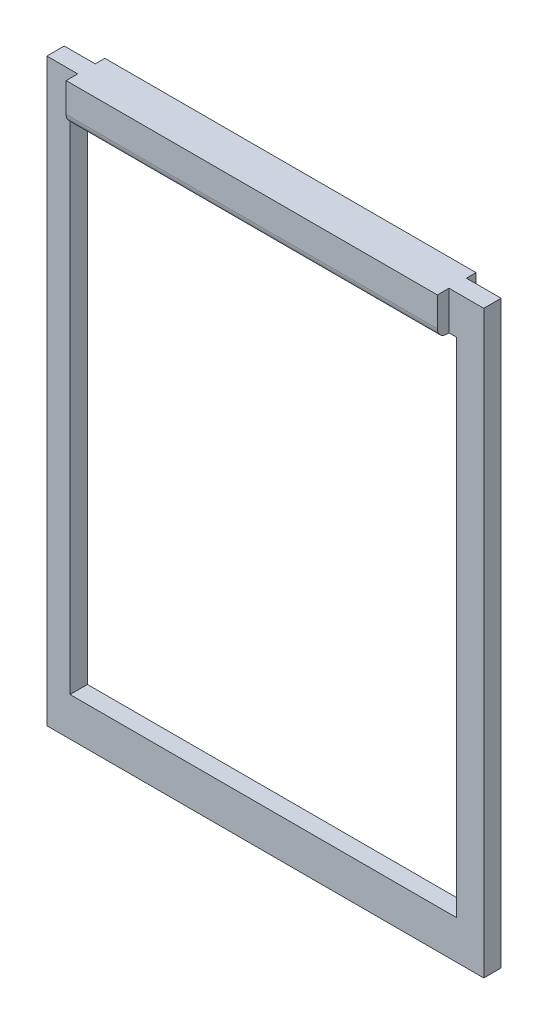
ISO-10303-21;
HEADER;
FILE_DESCRIPTION(('STEP AP214'),'2;1');
FILE_NAME('part.step','',(''),(''),'','','');
FILE_SCHEMA(('AUTOMOTIVE_DESIGN { 1 0 10303 214 1 1 1 1 }'));
ENDSEC;
DATA;
#1=APPLICATION_CONTEXT('core data for automotive mechanical design processes');
#2=APPLICATION_PROTOCOL_DEFINITION('international standard','automotive_design',2000,#1);
#3=PRODUCT_CONTEXT('',#1,'mechanical');
#4=PRODUCT('Part','Part','',(#3));
#5=PRODUCT_RELATED_PRODUCT_CATEGORY('part','',(#4));
#6=PRODUCT_DEFINITION_FORMATION('','',#4);
#7=PRODUCT_DEFINITION_CONTEXT('part definition',#1,'design');
#8=PRODUCT_DEFINITION('design','',#6,#7);
#9=PRODUCT_DEFINITION_SHAPE('','',#8);
#10=(LENGTH_UNIT() NAMED_UNIT(*) SI_UNIT(.MILLI.,.METRE.));
#11=(NAMED_UNIT(*) PLANE_ANGLE_UNIT() SI_UNIT($,.RADIAN.));
#12=(NAMED_UNIT(*) SI_UNIT($,.STERADIAN.) SOLID_ANGLE_UNIT());
#13=UNCERTAINTY_MEASURE_WITH_UNIT(LENGTH_MEASURE(1.E-05),#10,'distance_accuracy_value','');
#14=(GEOMETRIC_REPRESENTATION_CONTEXT(3) GLOBAL_UNCERTAINTY_ASSIGNED_CONTEXT((#13)) GLOBAL_UNIT_ASSIGNED_CONTEXT((#10,
#11,#12)) REPRESENTATION_CONTEXT('',''));
#15=CARTESIAN_POINT('',(0.,0.,0.));
#16=DIRECTION('',(0.,0.,1.));
#17=DIRECTION('',(1.,0.,0.));
#18=AXIS2_PLACEMENT_3D('',#15,#16,#17);
#19=CARTESIAN_POINT('',(0.,0.,2.25));
#20=DIRECTION('',(0.,0.,1.));
#21=DIRECTION('',(1.,0.,0.));
#22=AXIS2_PLACEMENT_3D('',#19,#20,#21);
#23=PLANE('',#22);
#24=DIRECTION('',(-1.,0.,0.));
#25=VECTOR('',#24,1.);
#26=CARTESIAN_POINT('',(56.5,75.,2.25));
#27=LINE('',#26,#25);
#28=CARTESIAN_POINT('',(56.5,75.,2.25));
#29=VERTEX_POINT('',#28);
#30=CARTESIAN_POINT('',(52.,75.,2.25));
#31=VERTEX_POINT('',#30);
#32=EDGE_CURVE('E302',#29,#31,#27,.T.);
#33=ORIENTED_EDGE('',*,*,#32,.T.);
#34=DIRECTION('',(0.,-1.,0.));
#35=VECTOR('',#34,1.);
#36=CARTESIAN_POINT('',(52.,75.,2.25));
#37=LINE('',#36,#35);
#38=CARTESIAN_POINT('',(52.,70.,2.25));
#39=VERTEX_POINT('',#38);
#40=EDGE_CURVE('E218',#31,#39,#37,.T.);
#41=ORIENTED_EDGE('',*,*,#40,.T.);
#42=DIRECTION('',(-1.,0.,0.));
#43=VECTOR('',#42,1.);
#44=CARTESIAN_POINT('',(53.,70.,2.25));
#45=LINE('',#44,#43);
#46=CARTESIAN_POINT('',(53.,70.,2.25));
#47=VERTEX_POINT('',#46);
#48=EDGE_CURVE('E245',#47,#39,#45,.T.);
#49=ORIENTED_EDGE('',*,*,#48,.F.);
#50=DIRECTION('',(0.,1.,0.));
#51=VECTOR('',#50,1.);
#52=CARTESIAN_POINT('',(53.,4.99999999999998,2.25));
#53=LINE('',#52,#51);
#54=CARTESIAN_POINT('',(53.,4.99999999999998,2.25));
#55=VERTEX_POINT('',#54);
#56=EDGE_CURVE('E257',#55,#47,#53,.T.);
#57=ORIENTED_EDGE('',*,*,#56,.F.);
#58=DIRECTION('',(1.,0.,0.));
#59=VECTOR('',#58,1.);
#60=CARTESIAN_POINT('',(3.00000000000001,4.99999999999998,2.25));
#61=LINE('',#60,#59);
#62=CARTESIAN_POINT('',(3.00000000000001,4.99999999999998,2.25));
#63=VERTEX_POINT('',#62);
#64=EDGE_CURVE('E253',#63,#55,#61,.T.);
#65=ORIENTED_EDGE('',*,*,#64,.F.);
#66=DIRECTION('',(0.,-1.,0.));
#67=VECTOR('',#66,1.);
#68=CARTESIAN_POINT('',(3.,70.,2.25));
#69=LINE('',#68,#67);
#70=CARTESIAN_POINT('',(3.,70.,2.25));
#71=VERTEX_POINT('',#70);
#72=EDGE_CURVE('E249',#71,#63,#69,.T.);
#73=ORIENTED_EDGE('',*,*,#72,.F.);
#74=CARTESIAN_POINT('',(4.,70.,2.25));
#75=VERTEX_POINT('',#74);
#76=EDGE_CURVE('E250',#75,#71,#45,.T.);
#77=ORIENTED_EDGE('',*,*,#76,.F.);
#78=DIRECTION('',(0.,-1.,0.));
#79=VECTOR('',#78,1.);
#80=CARTESIAN_POINT('',(4.,75.,2.25));
#81=LINE('',#80,#79);
#82=CARTESIAN_POINT('',(4.,75.,2.25));
#83=VERTEX_POINT('',#82);
#84=EDGE_CURVE('E212',#83,#75,#81,.T.);
#85=ORIENTED_EDGE('',*,*,#84,.F.);
#86=CARTESIAN_POINT('',(0.,75.,2.25));
#87=VERTEX_POINT('',#86);
#88=EDGE_CURVE('E301',#83,#87,#27,.T.);
#89=ORIENTED_EDGE('',*,*,#88,.T.);
#90=DIRECTION('',(0.,-1.,0.));
#91=VECTOR('',#90,1.);
#92=CARTESIAN_POINT('',(0.,75.,2.25));
#93=LINE('',#92,#91);
#94=CARTESIAN_POINT('',(0.,0.,2.25));
#95=VERTEX_POINT('',#94);
#96=EDGE_CURVE('E291',#87,#95,#93,.T.);
#97=ORIENTED_EDGE('',*,*,#96,.T.);
#98=DIRECTION('',(1.,0.,0.));
#99=VECTOR('',#98,1.);
#100=CARTESIAN_POINT('',(0.,0.,2.25));
#101=LINE('',#100,#99);
#102=CARTESIAN_POINT('',(56.5,0.,2.25));
#103=VERTEX_POINT('',#102);
#104=EDGE_CURVE('E295',#95,#103,#101,.T.);
#105=ORIENTED_EDGE('',*,*,#104,.T.);
#106=DIRECTION('',(0.,1.,0.));
#107=VECTOR('',#106,1.);
#108=CARTESIAN_POINT('',(56.5,0.,2.25));
#109=LINE('',#108,#107);
#110=EDGE_CURVE('E298',#103,#29,#109,.T.);
#111=ORIENTED_EDGE('',*,*,#110,.T.);
#112=EDGE_LOOP('',(#33,#41,#49,#57,#65,#73,#77,#85,#89,#97,#105,#111));
#113=FACE_BOUND('',#112,.T.);
#114=ADVANCED_FACE('F39',(#113),#23,.T.);
#115=CARTESIAN_POINT('',(0.,0.,0.));
#116=DIRECTION('',(0.,0.,1.));
#117=DIRECTION('',(1.,0.,0.));
#118=AXIS2_PLACEMENT_3D('',#115,#116,#117);
#119=PLANE('',#118);
#120=DIRECTION('',(-1.,0.,0.));
#121=VECTOR('',#120,1.);
#122=CARTESIAN_POINT('',(53.,70.,0.));
#123=LINE('',#122,#121);
#124=CARTESIAN_POINT('',(53.,70.,0.));
#125=VERTEX_POINT('',#124);
#126=CARTESIAN_POINT('',(52.,70.,0.));
#127=VERTEX_POINT('',#126);
#128=EDGE_CURVE('E261',#125,#127,#123,.T.);
#129=ORIENTED_EDGE('',*,*,#128,.T.);
#130=DIRECTION('',(0.,1.,0.));
#131=VECTOR('',#130,1.);
#132=CARTESIAN_POINT('',(52.,0.,0.));
#133=LINE('',#132,#131);
#134=CARTESIAN_POINT('',(52.,75.,0.));
#135=VERTEX_POINT('',#134);
#136=EDGE_CURVE('E209',#127,#135,#133,.T.);
#137=ORIENTED_EDGE('',*,*,#136,.T.);
#138=DIRECTION('',(-1.,0.,0.));
#139=VECTOR('',#138,1.);
#140=CARTESIAN_POINT('',(56.5,75.,0.));
#141=LINE('',#140,#139);
#142=CARTESIAN_POINT('',(56.5,75.,0.));
#143=VERTEX_POINT('',#142);
#144=EDGE_CURVE('E184',#143,#135,#141,.T.);
#145=ORIENTED_EDGE('',*,*,#144,.F.);
#146=DIRECTION('',(0.,1.,0.));
#147=VECTOR('',#146,1.);
#148=CARTESIAN_POINT('',(56.5,0.,0.));
#149=LINE('',#148,#147);
#150=CARTESIAN_POINT('',(56.5,0.,0.));
#151=VERTEX_POINT('',#150);
#152=EDGE_CURVE('E312',#151,#143,#149,.T.);
#153=ORIENTED_EDGE('',*,*,#152,.F.);
#154=DIRECTION('',(1.,0.,0.));
#155=VECTOR('',#154,1.);
#156=CARTESIAN_POINT('',(0.,0.,0.));
#157=LINE('',#156,#155);
#158=CARTESIAN_POINT('',(0.,0.,0.));
#159=VERTEX_POINT('',#158);
#160=EDGE_CURVE('E309',#159,#151,#157,.T.);
#161=ORIENTED_EDGE('',*,*,#160,.F.);
#162=DIRECTION('',(0.,-1.,0.));
#163=VECTOR('',#162,1.);
#164=CARTESIAN_POINT('',(0.,75.,0.));
#165=LINE('',#164,#163);
#166=CARTESIAN_POINT('',(0.,75.,0.));
#167=VERTEX_POINT('',#166);
#168=EDGE_CURVE('E290',#167,#159,#165,.T.);
#169=ORIENTED_EDGE('',*,*,#168,.F.);
#170=CARTESIAN_POINT('',(4.,75.,0.));
#171=VERTEX_POINT('',#170);
#172=EDGE_CURVE('E315',#171,#167,#141,.T.);
#173=ORIENTED_EDGE('',*,*,#172,.F.);
#174=DIRECTION('',(0.,-1.,0.));
#175=VECTOR('',#174,1.);
#176=CARTESIAN_POINT('',(3.99999999999998,0.,0.));
#177=LINE('',#176,#175);
#178=CARTESIAN_POINT('',(4.,70.,0.));
#179=VERTEX_POINT('',#178);
#180=EDGE_CURVE('E200',#171,#179,#177,.T.);
#181=ORIENTED_EDGE('',*,*,#180,.T.);
#182=CARTESIAN_POINT('',(3.,70.,0.));
#183=VERTEX_POINT('',#182);
#184=EDGE_CURVE('E244',#179,#183,#123,.T.);
#185=ORIENTED_EDGE('',*,*,#184,.T.);
#186=DIRECTION('',(0.,-1.,0.));
#187=VECTOR('',#186,1.);
#188=CARTESIAN_POINT('',(3.,70.,0.));
#189=LINE('',#188,#187);
#190=CARTESIAN_POINT('',(3.00000000000001,4.99999999999998,0.));
#191=VERTEX_POINT('',#190);
#192=EDGE_CURVE('E265',#183,#191,#189,.T.);
#193=ORIENTED_EDGE('',*,*,#192,.T.);
#194=DIRECTION('',(1.,0.,0.));
#195=VECTOR('',#194,1.);
#196=CARTESIAN_POINT('',(3.00000000000001,4.99999999999998,0.));
#197=LINE('',#196,#195);
#198=CARTESIAN_POINT('',(53.,4.99999999999998,0.));
#199=VERTEX_POINT('',#198);
#200=EDGE_CURVE('E269',#191,#199,#197,.T.);
#201=ORIENTED_EDGE('',*,*,#200,.T.);
#202=DIRECTION('',(0.,1.,0.));
#203=VECTOR('',#202,1.);
#204=CARTESIAN_POINT('',(53.,4.99999999999998,0.));
#205=LINE('',#204,#203);
#206=EDGE_CURVE('E273',#199,#125,#205,.T.);
#207=ORIENTED_EDGE('',*,*,#206,.T.);
#208=EDGE_LOOP('',(#129,#137,#145,#153,#161,#169,#173,#181,#185,#193,#201,#207));
#209=FACE_BOUND('',#208,.T.);
#210=ADVANCED_FACE('F357',(#209),#119,.F.);
#211=CARTESIAN_POINT('',(0.,75.,2.25));
#212=DIRECTION('',(1.,0.,0.));
#213=DIRECTION('',(0.,1.,0.));
#214=AXIS2_PLACEMENT_3D('',#211,#212,#213);
#215=PLANE('',#214);
#216=ORIENTED_EDGE('',*,*,#168,.T.);
#217=DIRECTION('',(0.,0.,-1.));
#218=VECTOR('',#217,1.);
#219=CARTESIAN_POINT('',(0.,0.,2.25));
#220=LINE('',#219,#218);
#221=EDGE_CURVE('E328',#95,#159,#220,.T.);
#222=ORIENTED_EDGE('',*,*,#221,.F.);
#223=ORIENTED_EDGE('',*,*,#96,.F.);
#224=DIRECTION('',(0.,0.,-1.));
#225=VECTOR('',#224,1.);
#226=CARTESIAN_POINT('',(0.,75.,2.25));
#227=LINE('',#226,#225);
#228=EDGE_CURVE('E305',#87,#167,#227,.T.);
#229=ORIENTED_EDGE('',*,*,#228,.T.);
#230=EDGE_LOOP('',(#216,#222,#223,#229));
#231=FACE_BOUND('',#230,.T.);
#232=ADVANCED_FACE('F380',(#231),#215,.F.);
#233=CARTESIAN_POINT('',(0.,0.,2.25));
#234=DIRECTION('',(0.,1.,0.));
#235=DIRECTION('',(0.,0.,1.));
#236=AXIS2_PLACEMENT_3D('',#233,#234,#235);
#237=PLANE('',#236);
#238=ORIENTED_EDGE('',*,*,#160,.T.);
#239=DIRECTION('',(0.,0.,-1.));
#240=VECTOR('',#239,1.);
#241=CARTESIAN_POINT('',(56.5,0.,2.25));
#242=LINE('',#241,#240);
#243=EDGE_CURVE('E324',#103,#151,#242,.T.);
#244=ORIENTED_EDGE('',*,*,#243,.F.);
#245=ORIENTED_EDGE('',*,*,#104,.F.);
#246=ORIENTED_EDGE('',*,*,#221,.T.);
#247=EDGE_LOOP('',(#238,#244,#245,#246));
#248=FACE_BOUND('',#247,.T.);
#249=ADVANCED_FACE('F383',(#248),#237,.F.);
#250=CARTESIAN_POINT('',(56.5,0.,2.25));
#251=DIRECTION('',(-1.,0.,0.));
#252=DIRECTION('',(0.,0.,1.));
#253=AXIS2_PLACEMENT_3D('',#250,#251,#252);
#254=PLANE('',#253);
#255=ORIENTED_EDGE('',*,*,#152,.T.);
#256=DIRECTION('',(0.,0.,-1.));
#257=VECTOR('',#256,1.);
#258=CARTESIAN_POINT('',(56.5,75.,2.25));
#259=LINE('',#258,#257);
#260=EDGE_CURVE('E321',#29,#143,#259,.T.);
#261=ORIENTED_EDGE('',*,*,#260,.F.);
#262=ORIENTED_EDGE('',*,*,#110,.F.);
#263=ORIENTED_EDGE('',*,*,#243,.T.);
#264=EDGE_LOOP('',(#255,#261,#262,#263));
#265=FACE_BOUND('',#264,.T.);
#266=ADVANCED_FACE('F388',(#265),#254,.F.);
#267=CARTESIAN_POINT('',(56.5,75.,2.25));
#268=DIRECTION('',(0.,-1.,0.));
#269=DIRECTION('',(1.,0.,0.));
#270=AXIS2_PLACEMENT_3D('',#267,#268,#269);
#271=PLANE('',#270);
#272=ORIENTED_EDGE('',*,*,#88,.F.);
#273=DIRECTION('',(0.,0.,-1.));
#274=VECTOR('',#273,1.);
#275=CARTESIAN_POINT('',(4.,75.,3.75));
#276=LINE('',#275,#274);
#277=CARTESIAN_POINT('',(4.,75.,3.75));
#278=VERTEX_POINT('',#277);
#279=EDGE_CURVE('E240',#278,#83,#276,.T.);
#280=ORIENTED_EDGE('',*,*,#279,.F.);
#281=DIRECTION('',(-1.,0.,0.));
#282=VECTOR('',#281,1.);
#283=CARTESIAN_POINT('',(52.,75.,3.75));
#284=LINE('',#283,#282);
#285=CARTESIAN_POINT('',(52.,75.,3.75));
#286=VERTEX_POINT('',#285);
#287=EDGE_CURVE('E213',#286,#278,#284,.T.);
#288=ORIENTED_EDGE('',*,*,#287,.F.);
#289=DIRECTION('',(0.,0.,-1.));
#290=VECTOR('',#289,1.);
#291=CARTESIAN_POINT('',(52.,75.,3.75));
#292=LINE('',#291,#290);
#293=EDGE_CURVE('E224',#286,#31,#292,.T.);
#294=ORIENTED_EDGE('',*,*,#293,.T.);
#295=ORIENTED_EDGE('',*,*,#32,.F.);
#296=ORIENTED_EDGE('',*,*,#260,.T.);
#297=ORIENTED_EDGE('',*,*,#144,.T.);
#298=DIRECTION('',(0.,0.,1.));
#299=VECTOR('',#298,1.);
#300=CARTESIAN_POINT('',(52.,75.,-1.25));
#301=LINE('',#300,#299);
#302=CARTESIAN_POINT('',(52.,75.,-1.25));
#303=VERTEX_POINT('',#302);
#304=EDGE_CURVE('E168',#303,#135,#301,.T.);
#305=ORIENTED_EDGE('',*,*,#304,.F.);
#306=DIRECTION('',(-1.,0.,0.));
#307=VECTOR('',#306,1.);
#308=CARTESIAN_POINT('',(52.,75.,-1.25));
#309=LINE('',#308,#307);
#310=CARTESIAN_POINT('',(4.,75.,-1.25));
#311=VERTEX_POINT('',#310);
#312=EDGE_CURVE('E175',#303,#311,#309,.T.);
#313=ORIENTED_EDGE('',*,*,#312,.T.);
#314=DIRECTION('',(0.,0.,1.));
#315=VECTOR('',#314,1.);
#316=CARTESIAN_POINT('',(4.,75.,-1.25));
#317=LINE('',#316,#315);
#318=EDGE_CURVE('E186',#311,#171,#317,.T.);
#319=ORIENTED_EDGE('',*,*,#318,.T.);
#320=ORIENTED_EDGE('',*,*,#172,.T.);
#321=ORIENTED_EDGE('',*,*,#228,.F.);
#322=EDGE_LOOP('',(#272,#280,#288,#294,#295,#296,#297,#305,#313,#319,#320,#321));
#323=FACE_BOUND('',#322,.T.);
#324=ADVANCED_FACE('F181',(#323),#271,.F.);
#325=CARTESIAN_POINT('',(53.,70.,2.25));
#326=DIRECTION('',(0.,-1.,0.));
#327=DIRECTION('',(0.,0.,-1.));
#328=AXIS2_PLACEMENT_3D('',#325,#326,#327);
#329=PLANE('',#328);
#330=DIRECTION('',(0.,0.,1.));
#331=VECTOR('',#330,1.);
#332=CARTESIAN_POINT('',(4.,70.,-1.25));
#333=LINE('',#332,#331);
#334=CARTESIAN_POINT('',(4.,70.,-0.0500000000000001));
#335=VERTEX_POINT('',#334);
#336=EDGE_CURVE('E201',#335,#179,#333,.T.);
#337=ORIENTED_EDGE('',*,*,#336,.F.);
#338=DIRECTION('',(1.,0.,0.));
#339=VECTOR('',#338,1.);
#340=CARTESIAN_POINT('',(53.,70.,-0.0500000000000001));
#341=LINE('',#340,#339);
#342=CARTESIAN_POINT('',(52.,70.,-0.0500000000000001));
#343=VERTEX_POINT('',#342);
#344=EDGE_CURVE('E336',#335,#343,#341,.T.);
#345=ORIENTED_EDGE('',*,*,#344,.T.);
#346=DIRECTION('',(0.,0.,1.));
#347=VECTOR('',#346,1.);
#348=CARTESIAN_POINT('',(52.,70.,-1.25));
#349=LINE('',#348,#347);
#350=EDGE_CURVE('E197',#343,#127,#349,.T.);
#351=ORIENTED_EDGE('',*,*,#350,.T.);
#352=ORIENTED_EDGE('',*,*,#128,.F.);
#353=DIRECTION('',(0.,0.,-1.));
#354=VECTOR('',#353,1.);
#355=CARTESIAN_POINT('',(53.,70.,2.25));
#356=LINE('',#355,#354);
#357=EDGE_CURVE('E260',#47,#125,#356,.T.);
#358=ORIENTED_EDGE('',*,*,#357,.F.);
#359=ORIENTED_EDGE('',*,*,#48,.T.);
#360=DIRECTION('',(0.,0.,-1.));
#361=VECTOR('',#360,1.);
#362=CARTESIAN_POINT('',(52.,70.,3.75));
#363=LINE('',#362,#361);
#364=CARTESIAN_POINT('',(52.,70.,2.55));
#365=VERTEX_POINT('',#364);
#366=EDGE_CURVE('E234',#365,#39,#363,.T.);
#367=ORIENTED_EDGE('',*,*,#366,.F.);
#368=DIRECTION('',(-1.,0.,0.));
#369=VECTOR('',#368,1.);
#370=CARTESIAN_POINT('',(53.,70.,2.55));
#371=LINE('',#370,#369);
#372=CARTESIAN_POINT('',(4.,70.,2.55));
#373=VERTEX_POINT('',#372);
#374=EDGE_CURVE('E332',#365,#373,#371,.T.);
#375=ORIENTED_EDGE('',*,*,#374,.T.);
#376=DIRECTION('',(0.,0.,-1.));
#377=VECTOR('',#376,1.);
#378=CARTESIAN_POINT('',(4.,70.,3.75));
#379=LINE('',#378,#377);
#380=EDGE_CURVE('E237',#373,#75,#379,.T.);
#381=ORIENTED_EDGE('',*,*,#380,.T.);
#382=ORIENTED_EDGE('',*,*,#76,.T.);
#383=DIRECTION('',(0.,0.,-1.));
#384=VECTOR('',#383,1.);
#385=CARTESIAN_POINT('',(3.,70.,2.25));
#386=LINE('',#385,#384);
#387=EDGE_CURVE('E286',#71,#183,#386,.T.);
#388=ORIENTED_EDGE('',*,*,#387,.T.);
#389=ORIENTED_EDGE('',*,*,#184,.F.);
#390=EDGE_LOOP('',(#337,#345,#351,#352,#358,#359,#367,#375,#381,#382,#388,#389));
#391=FACE_BOUND('',#390,.T.);
#392=ADVANCED_FACE('F368',(#391),#329,.T.);
#393=CARTESIAN_POINT('',(3.,70.,2.25));
#394=DIRECTION('',(1.,0.,0.));
#395=DIRECTION('',(0.,1.,0.));
#396=AXIS2_PLACEMENT_3D('',#393,#394,#395);
#397=PLANE('',#396);
#398=ORIENTED_EDGE('',*,*,#192,.F.);
#399=ORIENTED_EDGE('',*,*,#387,.F.);
#400=ORIENTED_EDGE('',*,*,#72,.T.);
#401=DIRECTION('',(0.,0.,-1.));
#402=VECTOR('',#401,1.);
#403=CARTESIAN_POINT('',(3.00000000000001,4.99999999999998,2.25));
#404=LINE('',#403,#402);
#405=EDGE_CURVE('E283',#63,#191,#404,.T.);
#406=ORIENTED_EDGE('',*,*,#405,.T.);
#407=EDGE_LOOP('',(#398,#399,#400,#406));
#408=FACE_BOUND('',#407,.T.);
#409=ADVANCED_FACE('F364',(#408),#397,.T.);
#410=CARTESIAN_POINT('',(3.00000000000001,4.99999999999998,2.25));
#411=DIRECTION('',(0.,1.,0.));
#412=DIRECTION('',(-1.,0.,0.));
#413=AXIS2_PLACEMENT_3D('',#410,#411,#412);
#414=PLANE('',#413);
#415=ORIENTED_EDGE('',*,*,#200,.F.);
#416=ORIENTED_EDGE('',*,*,#405,.F.);
#417=ORIENTED_EDGE('',*,*,#64,.T.);
#418=DIRECTION('',(0.,0.,-1.));
#419=VECTOR('',#418,1.);
#420=CARTESIAN_POINT('',(53.,4.99999999999998,2.25));
#421=LINE('',#420,#419);
#422=EDGE_CURVE('E280',#55,#199,#421,.T.);
#423=ORIENTED_EDGE('',*,*,#422,.T.);
#424=EDGE_LOOP('',(#415,#416,#417,#423));
#425=FACE_BOUND('',#424,.T.);
#426=ADVANCED_FACE('F449',(#425),#414,.T.);
#427=CARTESIAN_POINT('',(53.,4.99999999999998,2.25));
#428=DIRECTION('',(-1.,0.,0.));
#429=DIRECTION('',(0.,-1.,0.));
#430=AXIS2_PLACEMENT_3D('',#427,#428,#429);
#431=PLANE('',#430);
#432=ORIENTED_EDGE('',*,*,#206,.F.);
#433=ORIENTED_EDGE('',*,*,#422,.F.);
#434=ORIENTED_EDGE('',*,*,#56,.T.);
#435=ORIENTED_EDGE('',*,*,#357,.T.);
#436=EDGE_LOOP('',(#432,#433,#434,#435));
#437=FACE_BOUND('',#436,.T.);
#438=ADVANCED_FACE('F455',(#437),#431,.T.);
#439=CARTESIAN_POINT('',(4.,75.,3.75));
#440=DIRECTION('',(1.,0.,0.));
#441=DIRECTION('',(0.,1.,0.));
#442=AXIS2_PLACEMENT_3D('',#439,#440,#441);
#443=PLANE('',#442);
#444=ORIENTED_EDGE('',*,*,#380,.F.);
#445=CARTESIAN_POINT('',(4.,71.2,2.55));
#446=DIRECTION('',(1.,0.,0.));
#447=DIRECTION('',(0.,1.,0.));
#448=AXIS2_PLACEMENT_3D('',#445,#446,#447);
#449=CIRCLE('',#448,1.2);
#450=CARTESIAN_POINT('',(4.,71.2,3.75));
#451=VERTEX_POINT('',#450);
#452=EDGE_CURVE('E62',#373,#451,#449,.F.);
#453=ORIENTED_EDGE('',*,*,#452,.T.);
#454=DIRECTION('',(0.,-1.,0.));
#455=VECTOR('',#454,1.);
#456=CARTESIAN_POINT('',(4.,75.,3.75));
#457=LINE('',#456,#455);
#458=EDGE_CURVE('E217',#278,#451,#457,.T.);
#459=ORIENTED_EDGE('',*,*,#458,.F.);
#460=ORIENTED_EDGE('',*,*,#279,.T.);
#461=ORIENTED_EDGE('',*,*,#84,.T.);
#462=EDGE_LOOP('',(#444,#453,#459,#460,#461));
#463=FACE_BOUND('',#462,.T.);
#464=ADVANCED_FACE('F372',(#463),#443,.F.);
#465=CARTESIAN_POINT('',(52.,75.,3.75));
#466=DIRECTION('',(1.,0.,0.));
#467=DIRECTION('',(0.,0.,-1.));
#468=AXIS2_PLACEMENT_3D('',#465,#466,#467);
#469=PLANE('',#468);
#470=DIRECTION('',(0.,-1.,0.));
#471=VECTOR('',#470,1.);
#472=CARTESIAN_POINT('',(52.,75.,3.75));
#473=LINE('',#472,#471);
#474=CARTESIAN_POINT('',(52.,71.2,3.75));
#475=VERTEX_POINT('',#474);
#476=EDGE_CURVE('E221',#286,#475,#473,.T.);
#477=ORIENTED_EDGE('',*,*,#476,.T.);
#478=CARTESIAN_POINT('',(52.,71.2,2.55));
#479=DIRECTION('',(1.,0.,0.));
#480=DIRECTION('',(0.,0.,-1.));
#481=AXIS2_PLACEMENT_3D('',#478,#479,#480);
#482=CIRCLE('',#481,1.2);
#483=EDGE_CURVE('E11',#475,#365,#482,.T.);
#484=ORIENTED_EDGE('',*,*,#483,.T.);
#485=ORIENTED_EDGE('',*,*,#366,.T.);
#486=ORIENTED_EDGE('',*,*,#40,.F.);
#487=ORIENTED_EDGE('',*,*,#293,.F.);
#488=EDGE_LOOP('',(#477,#484,#485,#486,#487));
#489=FACE_BOUND('',#488,.T.);
#490=ADVANCED_FACE('F393',(#489),#469,.T.);
#491=CARTESIAN_POINT('',(0.,0.,3.75));
#492=DIRECTION('',(0.,0.,1.));
#493=DIRECTION('',(1.,0.,0.));
#494=AXIS2_PLACEMENT_3D('',#491,#492,#493);
#495=PLANE('',#494);
#496=ORIENTED_EDGE('',*,*,#458,.T.);
#497=DIRECTION('',(-1.,0.,0.));
#498=VECTOR('',#497,1.);
#499=CARTESIAN_POINT('',(0.,71.2,3.75));
#500=LINE('',#499,#498);
#501=EDGE_CURVE('E48',#451,#475,#500,.F.);
#502=ORIENTED_EDGE('',*,*,#501,.T.);
#503=ORIENTED_EDGE('',*,*,#476,.F.);
#504=ORIENTED_EDGE('',*,*,#287,.T.);
#505=EDGE_LOOP('',(#496,#502,#503,#504));
#506=FACE_BOUND('',#505,.T.);
#507=ADVANCED_FACE('F475',(#506),#495,.T.);
#508=CARTESIAN_POINT('',(52.,75.,-1.25));
#509=DIRECTION('',(1.,0.,0.));
#510=DIRECTION('',(0.,0.,-1.));
#511=AXIS2_PLACEMENT_3D('',#508,#509,#510);
#512=PLANE('',#511);
#513=ORIENTED_EDGE('',*,*,#350,.F.);
#514=CARTESIAN_POINT('',(52.,71.2,-0.0500000000000001));
#515=DIRECTION('',(1.,0.,0.));
#516=DIRECTION('',(0.,0.,-1.));
#517=AXIS2_PLACEMENT_3D('',#514,#515,#516);
#518=CIRCLE('',#517,1.2);
#519=CARTESIAN_POINT('',(52.,71.2,-1.25));
#520=VERTEX_POINT('',#519);
#521=EDGE_CURVE('E170',#343,#520,#518,.T.);
#522=ORIENTED_EDGE('',*,*,#521,.T.);
#523=DIRECTION('',(0.,1.,0.));
#524=VECTOR('',#523,1.);
#525=CARTESIAN_POINT('',(52.,75.,-1.25));
#526=LINE('',#525,#524);
#527=EDGE_CURVE('E163',#520,#303,#526,.T.);
#528=ORIENTED_EDGE('',*,*,#527,.T.);
#529=ORIENTED_EDGE('',*,*,#304,.T.);
#530=ORIENTED_EDGE('',*,*,#136,.F.);
#531=EDGE_LOOP('',(#513,#522,#528,#529,#530));
#532=FACE_BOUND('',#531,.T.);
#533=ADVANCED_FACE('F166',(#532),#512,.T.);
#534=CARTESIAN_POINT('',(4.,75.,-1.25));
#535=DIRECTION('',(-1.,0.,0.));
#536=DIRECTION('',(0.,-1.,0.));
#537=AXIS2_PLACEMENT_3D('',#534,#535,#536);
#538=PLANE('',#537);
#539=DIRECTION('',(0.,-1.,0.));
#540=VECTOR('',#539,1.);
#541=CARTESIAN_POINT('',(4.,75.,-1.25));
#542=LINE('',#541,#540);
#543=CARTESIAN_POINT('',(4.,71.2,-1.25));
#544=VERTEX_POINT('',#543);
#545=EDGE_CURVE('E187',#311,#544,#542,.T.);
#546=ORIENTED_EDGE('',*,*,#545,.T.);
#547=CARTESIAN_POINT('',(4.,71.2,-0.0500000000000001));
#548=DIRECTION('',(-1.,0.,0.));
#549=DIRECTION('',(0.,-1.,0.));
#550=AXIS2_PLACEMENT_3D('',#547,#548,#549);
#551=CIRCLE('',#550,1.2);
#552=EDGE_CURVE('E345',#544,#335,#551,.T.);
#553=ORIENTED_EDGE('',*,*,#552,.T.);
#554=ORIENTED_EDGE('',*,*,#336,.T.);
#555=ORIENTED_EDGE('',*,*,#180,.F.);
#556=ORIENTED_EDGE('',*,*,#318,.F.);
#557=EDGE_LOOP('',(#546,#553,#554,#555,#556));
#558=FACE_BOUND('',#557,.T.);
#559=ADVANCED_FACE('F488',(#558),#538,.T.);
#560=CARTESIAN_POINT('',(0.,0.,-1.25));
#561=DIRECTION('',(0.,0.,-1.));
#562=DIRECTION('',(-1.,0.,0.));
#563=AXIS2_PLACEMENT_3D('',#560,#561,#562);
#564=PLANE('',#563);
#565=ORIENTED_EDGE('',*,*,#527,.F.);
#566=DIRECTION('',(1.,0.,0.));
#567=VECTOR('',#566,1.);
#568=CARTESIAN_POINT('',(0.,71.2,-1.25));
#569=LINE('',#568,#567);
#570=EDGE_CURVE('E342',#520,#544,#569,.F.);
#571=ORIENTED_EDGE('',*,*,#570,.T.);
#572=ORIENTED_EDGE('',*,*,#545,.F.);
#573=ORIENTED_EDGE('',*,*,#312,.F.);
#574=EDGE_LOOP('',(#565,#571,#572,#573));
#575=FACE_BOUND('',#574,.T.);
#576=ADVANCED_FACE('F190',(#575),#564,.T.);
#577=CARTESIAN_POINT('',(53.,71.2,-0.0500000000000001));
#578=DIRECTION('',(1.,0.,0.));
#579=DIRECTION('',(0.,0.,-1.));
#580=AXIS2_PLACEMENT_3D('',#577,#578,#579);
#581=CYLINDRICAL_SURFACE('',#580,1.2);
#582=ORIENTED_EDGE('',*,*,#552,.F.);
#583=ORIENTED_EDGE('',*,*,#570,.F.);
#584=ORIENTED_EDGE('',*,*,#521,.F.);
#585=ORIENTED_EDGE('',*,*,#344,.F.);
#586=EDGE_LOOP('',(#582,#583,#584,#585));
#587=FACE_BOUND('',#586,.T.);
#588=ADVANCED_FACE('F400',(#587),#581,.T.);
#589=CARTESIAN_POINT('',(53.,71.2,2.55));
#590=DIRECTION('',(-1.,0.,0.));
#591=DIRECTION('',(0.,0.,1.));
#592=AXIS2_PLACEMENT_3D('',#589,#590,#591);
#593=CYLINDRICAL_SURFACE('',#592,1.2);
#594=ORIENTED_EDGE('',*,*,#483,.F.);
#595=ORIENTED_EDGE('',*,*,#501,.F.);
#596=ORIENTED_EDGE('',*,*,#452,.F.);
#597=ORIENTED_EDGE('',*,*,#374,.F.);
#598=EDGE_LOOP('',(#594,#595,#596,#597));
#599=FACE_BOUND('',#598,.T.);
#600=ADVANCED_FACE('F41',(#599),#593,.T.);
#601=CLOSED_SHELL('',(#114,#210,#232,#249,#266,#324,#392,#409,#426,#438,#464,#490,#507,#533,
#559,#576,#588,#600));
#602=MANIFOLD_SOLID_BREP('B2',#601);
#603=ADVANCED_BREP_SHAPE_REPRESENTATION('',(#18,#602),#14);
#604=SHAPE_DEFINITION_REPRESENTATION(#9,#603);
ENDSEC;
END-ISO-10303-21;
